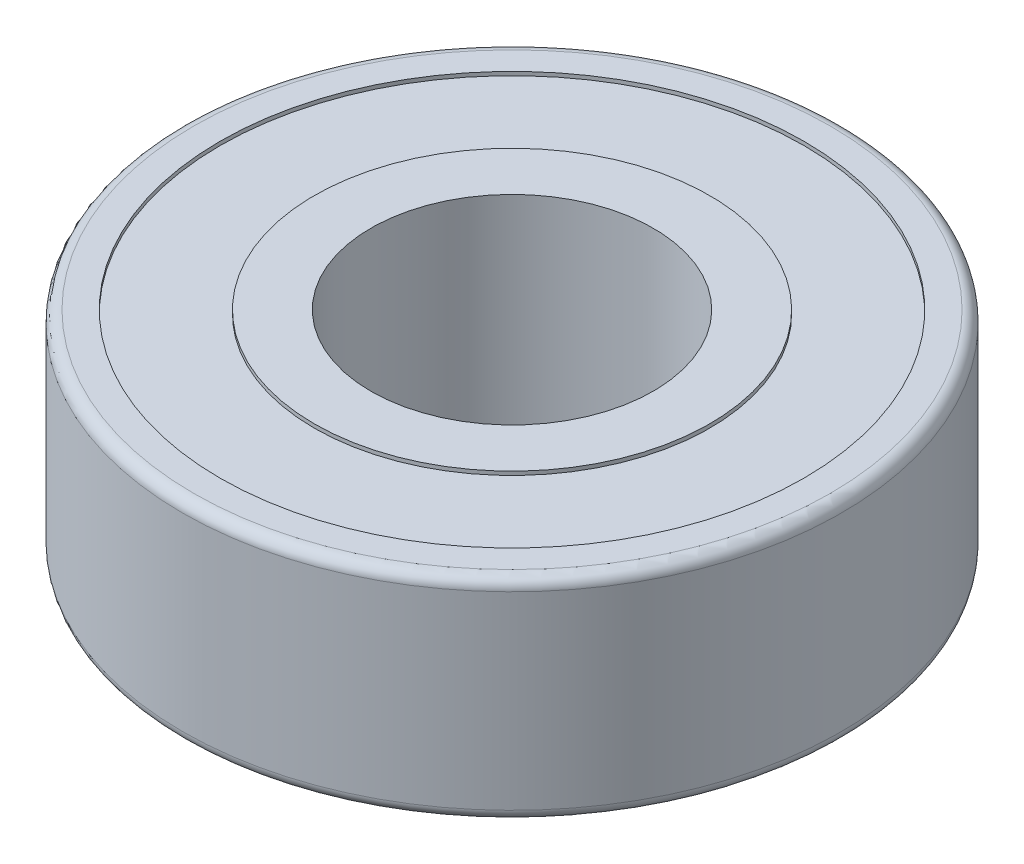
ISO-10303-21;
HEADER;
FILE_DESCRIPTION(('STEP AP214'),'2;1');
FILE_NAME('part.step','',(''),(''),'','','');
FILE_SCHEMA(('AUTOMOTIVE_DESIGN { 1 0 10303 214 1 1 1 1 }'));
ENDSEC;
DATA;
#1=APPLICATION_CONTEXT('core data for automotive mechanical design processes');
#2=APPLICATION_PROTOCOL_DEFINITION('international standard','automotive_design',2000,#1);
#3=PRODUCT_CONTEXT('',#1,'mechanical');
#4=PRODUCT('Part','Part','',(#3));
#5=PRODUCT_RELATED_PRODUCT_CATEGORY('part','',(#4));
#6=PRODUCT_DEFINITION_FORMATION('','',#4);
#7=PRODUCT_DEFINITION_CONTEXT('part definition',#1,'design');
#8=PRODUCT_DEFINITION('design','',#6,#7);
#9=PRODUCT_DEFINITION_SHAPE('','',#8);
#10=(LENGTH_UNIT() NAMED_UNIT(*) SI_UNIT(.MILLI.,.METRE.));
#11=(NAMED_UNIT(*) PLANE_ANGLE_UNIT() SI_UNIT($,.RADIAN.));
#12=(NAMED_UNIT(*) SI_UNIT($,.STERADIAN.) SOLID_ANGLE_UNIT());
#13=UNCERTAINTY_MEASURE_WITH_UNIT(LENGTH_MEASURE(1.E-05),#10,'distance_accuracy_value','');
#14=(GEOMETRIC_REPRESENTATION_CONTEXT(3) GLOBAL_UNCERTAINTY_ASSIGNED_CONTEXT((#13)) GLOBAL_UNIT_ASSIGNED_CONTEXT((#10,
#11,#12)) REPRESENTATION_CONTEXT('',''));
#15=CARTESIAN_POINT('',(0.,0.,0.));
#16=DIRECTION('',(0.,0.,1.));
#17=DIRECTION('',(1.,0.,0.));
#18=AXIS2_PLACEMENT_3D('',#15,#16,#17);
#19=CARTESIAN_POINT('',(0.,0.,0.));
#20=DIRECTION('',(0.,1.,0.));
#21=DIRECTION('',(0.,0.,1.));
#22=AXIS2_PLACEMENT_3D('',#19,#20,#21);
#23=PLANE('',#22);
#24=CARTESIAN_POINT('',(0.,0.,0.));
#25=DIRECTION('',(0.,1.,0.));
#26=DIRECTION('',(0.,0.,1.));
#27=AXIS2_PLACEMENT_3D('',#24,#25,#26);
#28=CIRCLE('',#27,4.7625);
#29=CARTESIAN_POINT('',(0.,0.,4.7625));
#30=VERTEX_POINT('',#29);
#31=EDGE_CURVE('E62',#30,#30,#28,.T.);
#32=ORIENTED_EDGE('',*,*,#31,.T.);
#33=EDGE_LOOP('',(#32));
#34=FACE_BOUND('',#33,.T.);
#35=CARTESIAN_POINT('',(0.,0.,0.));
#36=DIRECTION('',(0.,-1.,0.));
#37=DIRECTION('',(0.,0.,-1.));
#38=AXIS2_PLACEMENT_3D('',#35,#36,#37);
#39=CIRCLE('',#38,6.6675);
#40=CARTESIAN_POINT('',(0.,0.,-6.6675));
#41=VERTEX_POINT('',#40);
#42=EDGE_CURVE('E94',#41,#41,#39,.T.);
#43=ORIENTED_EDGE('',*,*,#42,.T.);
#44=EDGE_LOOP('',(#43));
#45=FACE_BOUND('',#44,.T.);
#46=ADVANCED_FACE('F37',(#34,#45),#23,.F.);
#47=CARTESIAN_POINT('',(0.,7.14375,0.));
#48=DIRECTION('',(0.,1.,0.));
#49=DIRECTION('',(0.,0.,1.));
#50=AXIS2_PLACEMENT_3D('',#47,#48,#49);
#51=PLANE('',#50);
#52=CARTESIAN_POINT('',(0.,7.14375,0.));
#53=DIRECTION('',(0.,1.,0.));
#54=DIRECTION('',(0.,0.,1.));
#55=AXIS2_PLACEMENT_3D('',#52,#53,#54);
#56=CIRCLE('',#55,4.7625);
#57=CARTESIAN_POINT('',(0.,7.14375,4.7625));
#58=VERTEX_POINT('',#57);
#59=EDGE_CURVE('E61',#58,#58,#56,.T.);
#60=ORIENTED_EDGE('',*,*,#59,.F.);
#61=EDGE_LOOP('',(#60));
#62=FACE_BOUND('',#61,.T.);
#63=CARTESIAN_POINT('',(0.,7.14375,0.));
#64=DIRECTION('',(0.,1.,0.));
#65=DIRECTION('',(0.,0.,1.));
#66=AXIS2_PLACEMENT_3D('',#63,#64,#65);
#67=CIRCLE('',#66,6.6675);
#68=CARTESIAN_POINT('',(0.,7.14375,6.6675));
#69=VERTEX_POINT('',#68);
#70=EDGE_CURVE('E78',#69,#69,#67,.T.);
#71=ORIENTED_EDGE('',*,*,#70,.T.);
#72=EDGE_LOOP('',(#71));
#73=FACE_BOUND('',#72,.T.);
#74=ADVANCED_FACE('F130',(#62,#73),#51,.T.);
#75=CARTESIAN_POINT('',(0.,7.14375,0.));
#76=DIRECTION('',(0.,1.,0.));
#77=DIRECTION('',(0.,0.,1.));
#78=AXIS2_PLACEMENT_3D('',#75,#76,#77);
#79=CIRCLE('',#78,10.7315);
#80=CARTESIAN_POINT('',(0.,7.14375,10.7315));
#81=VERTEX_POINT('',#80);
#82=EDGE_CURVE('E10',#81,#81,#79,.T.);
#83=ORIENTED_EDGE('',*,*,#82,.T.);
#84=EDGE_LOOP('',(#83));
#85=FACE_BOUND('',#84,.T.);
#86=CARTESIAN_POINT('',(0.,7.14375,0.));
#87=DIRECTION('',(0.,1.,0.));
#88=DIRECTION('',(0.,0.,1.));
#89=AXIS2_PLACEMENT_3D('',#86,#87,#88);
#90=CIRCLE('',#89,9.8425);
#91=CARTESIAN_POINT('',(0.,7.14375,9.8425));
#92=VERTEX_POINT('',#91);
#93=EDGE_CURVE('E70',#92,#92,#90,.T.);
#94=ORIENTED_EDGE('',*,*,#93,.F.);
#95=EDGE_LOOP('',(#94));
#96=FACE_BOUND('',#95,.T.);
#97=ADVANCED_FACE('F121',(#85,#96),#51,.T.);
#98=CARTESIAN_POINT('',(0.,0.,0.));
#99=DIRECTION('',(0.,1.,0.));
#100=DIRECTION('',(0.,0.,1.));
#101=AXIS2_PLACEMENT_3D('',#98,#99,#100);
#102=CIRCLE('',#101,10.7315);
#103=CARTESIAN_POINT('',(0.,0.,10.7315));
#104=VERTEX_POINT('',#103);
#105=EDGE_CURVE('E45',#104,#104,#102,.F.);
#106=ORIENTED_EDGE('',*,*,#105,.T.);
#107=EDGE_LOOP('',(#106));
#108=FACE_BOUND('',#107,.T.);
#109=CARTESIAN_POINT('',(0.,0.,0.));
#110=DIRECTION('',(0.,-1.,0.));
#111=DIRECTION('',(0.,0.,-1.));
#112=AXIS2_PLACEMENT_3D('',#109,#110,#111);
#113=CIRCLE('',#112,9.8425);
#114=CARTESIAN_POINT('',(0.,0.,-9.8425));
#115=VERTEX_POINT('',#114);
#116=EDGE_CURVE('E86',#115,#115,#113,.T.);
#117=ORIENTED_EDGE('',*,*,#116,.F.);
#118=EDGE_LOOP('',(#117));
#119=FACE_BOUND('',#118,.T.);
#120=ADVANCED_FACE('F118',(#108,#119),#23,.F.);
#121=CARTESIAN_POINT('',(0.,7.14375,0.));
#122=DIRECTION('',(0.,-1.,0.));
#123=DIRECTION('',(0.,0.,-1.));
#124=AXIS2_PLACEMENT_3D('',#121,#122,#123);
#125=CYLINDRICAL_SURFACE('',#124,11.1125);
#126=CARTESIAN_POINT('',(0.,0.381,0.));
#127=DIRECTION('',(0.,1.,0.));
#128=DIRECTION('',(0.,0.,1.));
#129=AXIS2_PLACEMENT_3D('',#126,#127,#128);
#130=CIRCLE('',#129,11.1125);
#131=CARTESIAN_POINT('',(0.,0.381,11.1125));
#132=VERTEX_POINT('',#131);
#133=EDGE_CURVE('E50',#132,#132,#130,.T.);
#134=ORIENTED_EDGE('',*,*,#133,.T.);
#135=EDGE_LOOP('',(#134));
#136=FACE_BOUND('',#135,.T.);
#137=CARTESIAN_POINT('',(0.,6.76275,0.));
#138=DIRECTION('',(0.,1.,0.));
#139=DIRECTION('',(0.,0.,1.));
#140=AXIS2_PLACEMENT_3D('',#137,#138,#139);
#141=CIRCLE('',#140,11.1125);
#142=CARTESIAN_POINT('',(0.,6.76275,11.1125));
#143=VERTEX_POINT('',#142);
#144=EDGE_CURVE('E55',#143,#143,#141,.F.);
#145=ORIENTED_EDGE('',*,*,#144,.T.);
#146=EDGE_LOOP('',(#145));
#147=FACE_BOUND('',#146,.T.);
#148=ADVANCED_FACE('F120',(#136,#147),#125,.T.);
#149=CARTESIAN_POINT('',(0.,7.14375,0.));
#150=DIRECTION('',(0.,-1.,0.));
#151=DIRECTION('',(0.,0.,-1.));
#152=AXIS2_PLACEMENT_3D('',#149,#150,#151);
#153=CYLINDRICAL_SURFACE('',#152,4.7625);
#154=ORIENTED_EDGE('',*,*,#59,.T.);
#155=EDGE_LOOP('',(#154));
#156=FACE_BOUND('',#155,.T.);
#157=ORIENTED_EDGE('',*,*,#31,.F.);
#158=EDGE_LOOP('',(#157));
#159=FACE_BOUND('',#158,.T.);
#160=ADVANCED_FACE('F127',(#156,#159),#153,.F.);
#161=CARTESIAN_POINT('',(0.,7.01675,0.));
#162=DIRECTION('',(0.,1.,0.));
#163=DIRECTION('',(0.,0.,1.));
#164=AXIS2_PLACEMENT_3D('',#161,#162,#163);
#165=CYLINDRICAL_SURFACE('',#164,9.8425);
#166=CARTESIAN_POINT('',(0.,7.01675,0.));
#167=DIRECTION('',(0.,1.,0.));
#168=DIRECTION('',(0.,0.,1.));
#169=AXIS2_PLACEMENT_3D('',#166,#167,#168);
#170=CIRCLE('',#169,9.8425);
#171=CARTESIAN_POINT('',(0.,7.01675,9.8425));
#172=VERTEX_POINT('',#171);
#173=EDGE_CURVE('E66',#172,#172,#170,.T.);
#174=ORIENTED_EDGE('',*,*,#173,.F.);
#175=EDGE_LOOP('',(#174));
#176=FACE_BOUND('',#175,.T.);
#177=ORIENTED_EDGE('',*,*,#93,.T.);
#178=EDGE_LOOP('',(#177));
#179=FACE_BOUND('',#178,.T.);
#180=ADVANCED_FACE('F155',(#176,#179),#165,.F.);
#181=CARTESIAN_POINT('',(0.,7.01675,0.));
#182=DIRECTION('',(0.,1.,0.));
#183=DIRECTION('',(0.,0.,1.));
#184=AXIS2_PLACEMENT_3D('',#181,#182,#183);
#185=PLANE('',#184);
#186=CARTESIAN_POINT('',(0.,7.01675,0.));
#187=DIRECTION('',(0.,1.,0.));
#188=DIRECTION('',(0.,0.,1.));
#189=AXIS2_PLACEMENT_3D('',#186,#187,#188);
#190=CIRCLE('',#189,6.6675);
#191=CARTESIAN_POINT('',(0.,7.01675,6.6675));
#192=VERTEX_POINT('',#191);
#193=EDGE_CURVE('E74',#192,#192,#190,.T.);
#194=ORIENTED_EDGE('',*,*,#193,.F.);
#195=EDGE_LOOP('',(#194));
#196=FACE_BOUND('',#195,.T.);
#197=ORIENTED_EDGE('',*,*,#173,.T.);
#198=EDGE_LOOP('',(#197));
#199=FACE_BOUND('',#198,.T.);
#200=ADVANCED_FACE('F151',(#196,#199),#185,.T.);
#201=CARTESIAN_POINT('',(0.,7.01675,0.));
#202=DIRECTION('',(0.,1.,0.));
#203=DIRECTION('',(0.,0.,1.));
#204=AXIS2_PLACEMENT_3D('',#201,#202,#203);
#205=CYLINDRICAL_SURFACE('',#204,6.6675);
#206=ORIENTED_EDGE('',*,*,#193,.T.);
#207=EDGE_LOOP('',(#206));
#208=FACE_BOUND('',#207,.T.);
#209=ORIENTED_EDGE('',*,*,#70,.F.);
#210=EDGE_LOOP('',(#209));
#211=FACE_BOUND('',#210,.T.);
#212=ADVANCED_FACE('F114',(#208,#211),#205,.T.);
#213=CARTESIAN_POINT('',(0.,0.127,0.));
#214=DIRECTION('',(0.,-1.,0.));
#215=DIRECTION('',(0.,0.,-1.));
#216=AXIS2_PLACEMENT_3D('',#213,#214,#215);
#217=CYLINDRICAL_SURFACE('',#216,9.8425);
#218=CARTESIAN_POINT('',(0.,0.127,0.));
#219=DIRECTION('',(0.,-1.,0.));
#220=DIRECTION('',(0.,0.,-1.));
#221=AXIS2_PLACEMENT_3D('',#218,#219,#220);
#222=CIRCLE('',#221,9.8425);
#223=CARTESIAN_POINT('',(0.,0.127,-9.8425));
#224=VERTEX_POINT('',#223);
#225=EDGE_CURVE('E82',#224,#224,#222,.T.);
#226=ORIENTED_EDGE('',*,*,#225,.F.);
#227=EDGE_LOOP('',(#226));
#228=FACE_BOUND('',#227,.T.);
#229=ORIENTED_EDGE('',*,*,#116,.T.);
#230=EDGE_LOOP('',(#229));
#231=FACE_BOUND('',#230,.T.);
#232=ADVANCED_FACE('F108',(#228,#231),#217,.F.);
#233=CARTESIAN_POINT('',(0.,0.127,0.));
#234=DIRECTION('',(0.,-1.,0.));
#235=DIRECTION('',(0.,0.,-1.));
#236=AXIS2_PLACEMENT_3D('',#233,#234,#235);
#237=PLANE('',#236);
#238=CARTESIAN_POINT('',(0.,0.127,0.));
#239=DIRECTION('',(0.,-1.,0.));
#240=DIRECTION('',(0.,0.,-1.));
#241=AXIS2_PLACEMENT_3D('',#238,#239,#240);
#242=CIRCLE('',#241,6.6675);
#243=CARTESIAN_POINT('',(0.,0.127,-6.6675));
#244=VERTEX_POINT('',#243);
#245=EDGE_CURVE('E90',#244,#244,#242,.T.);
#246=ORIENTED_EDGE('',*,*,#245,.F.);
#247=EDGE_LOOP('',(#246));
#248=FACE_BOUND('',#247,.T.);
#249=ORIENTED_EDGE('',*,*,#225,.T.);
#250=EDGE_LOOP('',(#249));
#251=FACE_BOUND('',#250,.T.);
#252=ADVANCED_FACE('F105',(#248,#251),#237,.T.);
#253=CARTESIAN_POINT('',(0.,0.127,0.));
#254=DIRECTION('',(0.,-1.,0.));
#255=DIRECTION('',(0.,0.,-1.));
#256=AXIS2_PLACEMENT_3D('',#253,#254,#255);
#257=CYLINDRICAL_SURFACE('',#256,6.6675);
#258=ORIENTED_EDGE('',*,*,#245,.T.);
#259=EDGE_LOOP('',(#258));
#260=FACE_BOUND('',#259,.T.);
#261=ORIENTED_EDGE('',*,*,#42,.F.);
#262=EDGE_LOOP('',(#261));
#263=FACE_BOUND('',#262,.T.);
#264=ADVANCED_FACE('F102',(#260,#263),#257,.T.);
#265=CARTESIAN_POINT('',(0.,0.381,0.));
#266=DIRECTION('',(0.,1.,0.));
#267=DIRECTION('',(0.,0.,1.));
#268=AXIS2_PLACEMENT_3D('',#265,#266,#267);
#269=TOROIDAL_SURFACE('',#268,10.7315,0.381);
#270=ORIENTED_EDGE('',*,*,#105,.F.);
#271=EDGE_LOOP('',(#270));
#272=FACE_BOUND('',#271,.T.);
#273=ORIENTED_EDGE('',*,*,#133,.F.);
#274=EDGE_LOOP('',(#273));
#275=FACE_BOUND('',#274,.T.);
#276=ADVANCED_FACE('F142',(#272,#275),#269,.T.);
#277=CARTESIAN_POINT('',(0.,6.76275,0.));
#278=DIRECTION('',(0.,1.,0.));
#279=DIRECTION('',(0.,0.,1.));
#280=AXIS2_PLACEMENT_3D('',#277,#278,#279);
#281=TOROIDAL_SURFACE('',#280,10.7315,0.381);
#282=ORIENTED_EDGE('',*,*,#144,.F.);
#283=EDGE_LOOP('',(#282));
#284=FACE_BOUND('',#283,.T.);
#285=ORIENTED_EDGE('',*,*,#82,.F.);
#286=EDGE_LOOP('',(#285));
#287=FACE_BOUND('',#286,.T.);
#288=ADVANCED_FACE('F39',(#284,#287),#281,.T.);
#289=CLOSED_SHELL('',(#46,#74,#97,#120,#148,#160,#180,#200,#212,#232,#252,#264,#276,#288));
#290=MANIFOLD_SOLID_BREP('B2',#289);
#291=ADVANCED_BREP_SHAPE_REPRESENTATION('',(#18,#290),#14);
#292=SHAPE_DEFINITION_REPRESENTATION(#9,#291);
ENDSEC;
END-ISO-10303-21;
